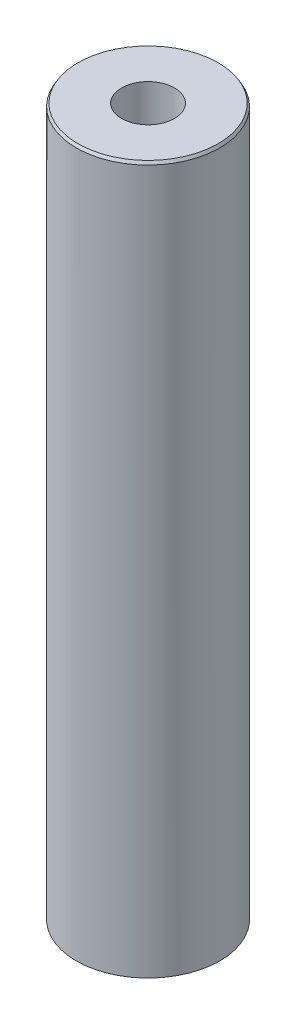
ISO-10303-21;
HEADER;
FILE_DESCRIPTION(('STEP AP214'),'2;1');
FILE_NAME('part.step','',(''),(''),'','','');
FILE_SCHEMA(('AUTOMOTIVE_DESIGN { 1 0 10303 214 1 1 1 1 }'));
ENDSEC;
DATA;
#1=APPLICATION_CONTEXT('core data for automotive mechanical design processes');
#2=APPLICATION_PROTOCOL_DEFINITION('international standard','automotive_design',2000,#1);
#3=PRODUCT_CONTEXT('',#1,'mechanical');
#4=PRODUCT('Part','Part','',(#3));
#5=PRODUCT_RELATED_PRODUCT_CATEGORY('part','',(#4));
#6=PRODUCT_DEFINITION_FORMATION('','',#4);
#7=PRODUCT_DEFINITION_CONTEXT('part definition',#1,'design');
#8=PRODUCT_DEFINITION('design','',#6,#7);
#9=PRODUCT_DEFINITION_SHAPE('','',#8);
#10=(LENGTH_UNIT() NAMED_UNIT(*) SI_UNIT(.MILLI.,.METRE.));
#11=(NAMED_UNIT(*) PLANE_ANGLE_UNIT() SI_UNIT($,.RADIAN.));
#12=(NAMED_UNIT(*) SI_UNIT($,.STERADIAN.) SOLID_ANGLE_UNIT());
#13=UNCERTAINTY_MEASURE_WITH_UNIT(LENGTH_MEASURE(1.E-05),#10,'distance_accuracy_value','');
#14=(GEOMETRIC_REPRESENTATION_CONTEXT(3) GLOBAL_UNCERTAINTY_ASSIGNED_CONTEXT((#13)) GLOBAL_UNIT_ASSIGNED_CONTEXT((#10,
#11,#12)) REPRESENTATION_CONTEXT('',''));
#15=CARTESIAN_POINT('',(0.,0.,0.));
#16=DIRECTION('',(0.,0.,1.));
#17=DIRECTION('',(1.,0.,0.));
#18=AXIS2_PLACEMENT_3D('',#15,#16,#17);
#19=CARTESIAN_POINT('',(0.,222.138337360227,0.));
#20=DIRECTION('',(0.,-1.,0.));
#21=DIRECTION('',(0.,0.,-1.));
#22=AXIS2_PLACEMENT_3D('',#19,#20,#21);
#23=CYLINDRICAL_SURFACE('',#22,22.5);
#24=CARTESIAN_POINT('',(0.,221.245079597205,0.));
#25=DIRECTION('',(0.,1.,0.));
#26=DIRECTION('',(0.,0.,1.));
#27=AXIS2_PLACEMENT_3D('',#24,#25,#26);
#28=CIRCLE('',#27,22.5);
#29=CARTESIAN_POINT('',(0.,221.245079597205,-22.5));
#30=VERTEX_POINT('',#29);
#31=EDGE_CURVE('E50',#30,#30,#28,.F.);
#32=ORIENTED_EDGE('',*,*,#31,.T.);
#33=EDGE_LOOP('',(#32));
#34=FACE_BOUND('',#33,.T.);
#35=CARTESIAN_POINT('',(0.,0.515722609936431,0.));
#36=DIRECTION('',(0.,1.,0.));
#37=DIRECTION('',(0.,0.,1.));
#38=AXIS2_PLACEMENT_3D('',#35,#36,#37);
#39=CIRCLE('',#38,22.5);
#40=CARTESIAN_POINT('',(0.,0.515722609936431,22.5));
#41=VERTEX_POINT('',#40);
#42=EDGE_CURVE('E51',#41,#41,#39,.T.);
#43=ORIENTED_EDGE('',*,*,#42,.T.);
#44=EDGE_LOOP('',(#43));
#45=FACE_BOUND('',#44,.T.);
#46=ADVANCED_FACE('F39',(#34,#45),#23,.T.);
#47=CARTESIAN_POINT('',(0.,222.138337360227,0.));
#48=DIRECTION('',(0.,1.,0.));
#49=DIRECTION('',(0.,0.,1.));
#50=AXIS2_PLACEMENT_3D('',#47,#48,#49);
#51=PLANE('',#50);
#52=CARTESIAN_POINT('',(0.,222.138337360227,0.));
#53=DIRECTION('',(0.,1.,0.));
#54=DIRECTION('',(0.,0.,1.));
#55=AXIS2_PLACEMENT_3D('',#52,#53,#54);
#56=CIRCLE('',#55,21.9842773900636);
#57=CARTESIAN_POINT('',(0.,222.138337360227,-21.9842773900636));
#58=VERTEX_POINT('',#57);
#59=EDGE_CURVE('E54',#58,#58,#56,.T.);
#60=ORIENTED_EDGE('',*,*,#59,.T.);
#61=EDGE_LOOP('',(#60));
#62=FACE_BOUND('',#61,.T.);
#63=CARTESIAN_POINT('',(0.,222.138337360227,0.));
#64=DIRECTION('',(0.,1.,0.));
#65=DIRECTION('',(0.,0.,1.));
#66=AXIS2_PLACEMENT_3D('',#63,#64,#65);
#67=CIRCLE('',#66,8.30021459850673);
#68=CARTESIAN_POINT('',(0.,222.138337360227,8.30021459850673));
#69=VERTEX_POINT('',#68);
#70=EDGE_CURVE('E58',#69,#69,#67,.T.);
#71=ORIENTED_EDGE('',*,*,#70,.F.);
#72=EDGE_LOOP('',(#71));
#73=FACE_BOUND('',#72,.T.);
#74=ADVANCED_FACE('F69',(#62,#73),#51,.T.);
#75=CARTESIAN_POINT('',(0.,0.,0.));
#76=DIRECTION('',(0.,1.,0.));
#77=DIRECTION('',(0.,0.,1.));
#78=AXIS2_PLACEMENT_3D('',#75,#76,#77);
#79=PLANE('',#78);
#80=CARTESIAN_POINT('',(0.,0.,0.));
#81=DIRECTION('',(0.,1.,0.));
#82=DIRECTION('',(0.,0.,1.));
#83=AXIS2_PLACEMENT_3D('',#80,#81,#82);
#84=CIRCLE('',#83,21.6067422369781);
#85=CARTESIAN_POINT('',(0.,0.,21.6067422369781));
#86=VERTEX_POINT('',#85);
#87=EDGE_CURVE('E10',#86,#86,#84,.F.);
#88=ORIENTED_EDGE('',*,*,#87,.T.);
#89=EDGE_LOOP('',(#88));
#90=FACE_BOUND('',#89,.T.);
#91=CARTESIAN_POINT('',(0.,0.,0.));
#92=DIRECTION('',(0.,1.,0.));
#93=DIRECTION('',(0.,0.,1.));
#94=AXIS2_PLACEMENT_3D('',#91,#92,#93);
#95=CIRCLE('',#94,8.30021459850673);
#96=CARTESIAN_POINT('',(0.,0.,8.30021459850673));
#97=VERTEX_POINT('',#96);
#98=EDGE_CURVE('E63',#97,#97,#95,.T.);
#99=ORIENTED_EDGE('',*,*,#98,.T.);
#100=EDGE_LOOP('',(#99));
#101=FACE_BOUND('',#100,.T.);
#102=ADVANCED_FACE('F75',(#90,#101),#79,.F.);
#103=CARTESIAN_POINT('',(0.,222.138337360227,0.));
#104=DIRECTION('',(0.,-1.,0.));
#105=DIRECTION('',(0.,0.,-1.));
#106=AXIS2_PLACEMENT_3D('',#103,#104,#105);
#107=CYLINDRICAL_SURFACE('',#106,8.30021459850673);
#108=ORIENTED_EDGE('',*,*,#70,.T.);
#109=EDGE_LOOP('',(#108));
#110=FACE_BOUND('',#109,.T.);
#111=ORIENTED_EDGE('',*,*,#98,.F.);
#112=EDGE_LOOP('',(#111));
#113=FACE_BOUND('',#112,.T.);
#114=ADVANCED_FACE('F70',(#110,#113),#107,.F.);
#115=CARTESIAN_POINT('',(0.,222.138337360227,0.));
#116=DIRECTION('',(0.,-1.,0.));
#117=DIRECTION('',(0.,0.,-1.));
#118=AXIS2_PLACEMENT_3D('',#115,#116,#117);
#119=CONICAL_SURFACE('',#118,21.9842773900636,0.523598775598308);
#120=CARTESIAN_POINT('',(0.,221.245079597205,-22.5));
#121=CARTESIAN_POINT('',(0.,221.25438436557,-22.4946278894798));
#122=CARTESIAN_POINT('',(0.,221.263689133935,-22.4892557789597));
#123=CARTESIAN_POINT('',(0.,221.282298670665,-22.4785115579193));
#124=CARTESIAN_POINT('',(0.,221.291603439029,-22.4731394473992));
#125=CARTESIAN_POINT('',(0.,221.310212975759,-22.4623952263588));
#126=CARTESIAN_POINT('',(0.,221.319517744124,-22.4570231158386));
#127=CARTESIAN_POINT('',(0.,221.338127280853,-22.4462788947983));
#128=CARTESIAN_POINT('',(0.,221.347432049218,-22.4409067842781));
#129=CARTESIAN_POINT('',(0.,221.366041585948,-22.4301625632378));
#130=CARTESIAN_POINT('',(0.,221.375346354313,-22.4247904527176));
#131=CARTESIAN_POINT('',(0.,221.393955891042,-22.4140462316773));
#132=CARTESIAN_POINT('',(0.,221.403260659407,-22.4086741211571));
#133=CARTESIAN_POINT('',(0.,221.421870196137,-22.3979299001168));
#134=CARTESIAN_POINT('',(0.,221.431174964502,-22.3925577895966));
#135=CARTESIAN_POINT('',(0.,221.449784501231,-22.3818135685563));
#136=CARTESIAN_POINT('',(0.,221.459089269596,-22.3764414580361));
#137=CARTESIAN_POINT('',(0.,221.477698806326,-22.3656972369957));
#138=CARTESIAN_POINT('',(0.,221.48700357469,-22.3603251264756));
#139=CARTESIAN_POINT('',(0.,221.50561311142,-22.3495809054352));
#140=CARTESIAN_POINT('',(0.,221.514917879785,-22.3442087949151));
#141=CARTESIAN_POINT('',(0.,221.533527416514,-22.3334645738747));
#142=CARTESIAN_POINT('',(0.,221.542832184879,-22.3280924633545));
#143=CARTESIAN_POINT('',(0.,221.561441721609,-22.3173482423142));
#144=CARTESIAN_POINT('',(0.,221.570746489974,-22.311976131794));
#145=CARTESIAN_POINT('',(0.,221.589356026703,-22.3012319107537));
#146=CARTESIAN_POINT('',(0.,221.598660795068,-22.2958598002335));
#147=CARTESIAN_POINT('',(0.,221.617270331798,-22.2851155791932));
#148=CARTESIAN_POINT('',(0.,221.626575100163,-22.279743468673));
#149=CARTESIAN_POINT('',(0.,221.645184636892,-22.2689992476327));
#150=CARTESIAN_POINT('',(0.,221.654489405257,-22.2636271371125));
#151=CARTESIAN_POINT('',(0.,221.673098941987,-22.2528829160721));
#152=CARTESIAN_POINT('',(0.,221.682403710351,-22.247510805552));
#153=CARTESIAN_POINT('',(0.,221.701013247081,-22.2367665845116));
#154=CARTESIAN_POINT('',(0.,221.710318015446,-22.2313944739915));
#155=CARTESIAN_POINT('',(0.,221.728927552176,-22.2206502529511));
#156=CARTESIAN_POINT('',(0.,221.73823232054,-22.215278142431));
#157=CARTESIAN_POINT('',(0.,221.75684185727,-22.2045339213906));
#158=CARTESIAN_POINT('',(0.,221.766146625635,-22.1991618108704));
#159=CARTESIAN_POINT('',(0.,221.784756162364,-22.1884175898301));
#160=CARTESIAN_POINT('',(0.,221.794060930729,-22.1830454793099));
#161=CARTESIAN_POINT('',(0.,221.812670467459,-22.1723012582696));
#162=CARTESIAN_POINT('',(0.,221.821975235824,-22.1669291477494));
#163=CARTESIAN_POINT('',(0.,221.840584772553,-22.1561849267091));
#164=CARTESIAN_POINT('',(0.,221.849889540918,-22.1508128161889));
#165=CARTESIAN_POINT('',(0.,221.868499077648,-22.1400685951486));
#166=CARTESIAN_POINT('',(0.,221.877803846012,-22.1346964846284));
#167=CARTESIAN_POINT('',(0.,221.896413382742,-22.123952263588));
#168=CARTESIAN_POINT('',(0.,221.905718151107,-22.1185801530679));
#169=CARTESIAN_POINT('',(0.,221.924327687837,-22.1078359320275));
#170=CARTESIAN_POINT('',(0.,221.933632456201,-22.1024638215074));
#171=CARTESIAN_POINT('',(0.,221.952241992931,-22.091719600467));
#172=CARTESIAN_POINT('',(0.,221.961546761296,-22.0863474899468));
#173=CARTESIAN_POINT('',(0.,221.980156298025,-22.0756032689065));
#174=CARTESIAN_POINT('',(0.,221.98946106639,-22.0702311583863));
#175=CARTESIAN_POINT('',(0.,222.00807060312,-22.059486937346));
#176=CARTESIAN_POINT('',(0.,222.017375371485,-22.0541148268258));
#177=CARTESIAN_POINT('',(0.,222.035984908214,-22.0433706057855));
#178=CARTESIAN_POINT('',(0.,222.045289676579,-22.0379984952653));
#179=CARTESIAN_POINT('',(0.,222.063899213309,-22.027254274225));
#180=CARTESIAN_POINT('',(0.,222.073203981674,-22.0218821637048));
#181=CARTESIAN_POINT('',(0.,222.091813518403,-22.0111379426645));
#182=CARTESIAN_POINT('',(0.,222.101118286768,-22.0057658321443));
#183=CARTESIAN_POINT('',(0.,222.119727823498,-21.9950216111039));
#184=CARTESIAN_POINT('',(0.,222.129032591862,-21.9896495005838));
#185=CARTESIAN_POINT('',(0.,222.138337360227,-21.9842773900636));
#186=B_SPLINE_CURVE_WITH_KNOTS('',3,(#120,#121,#122,#123,#124,#125,#126,#127,#128,#129,#130,
#131,#132,#133,#134,#135,#136,#137,#138,#139,#140,#141,#142,#143,#144,#145,#146,#147,#148,#149,
#150,#151,#152,#153,#154,#155,#156,#157,#158,#159,#160,#161,#162,#163,#164,#165,#166,#167,#168,
#169,#170,#171,#172,#173,#174,#175,#176,#177,#178,#179,#180,#181,#182,#183,#184,#185),
.UNSPECIFIED.,.F.,.F.,(4,2,2,2,2,2,2,2,2,2,2,2,2,2,2,2,2,2,2,2,2,2,2,2,2,2,2,2,2,2,2,2,4),(0.,
0.03223266312103,0.0644653262420601,0.0966979893630918,0.128930652484122,0.161163315605128,
0.19339597872616,0.22562864184719,0.25786130496822,0.290093968089251,0.322326631210257,
0.354559294331287,0.386791957452319,0.419024620573349,0.451257283694357,0.483489946815387,
0.515722609936417,0.547955273057449,0.580187936178479,0.612420599299485,0.644653262420517,
0.676885925541547,0.709118588662577,0.741351251783585,0.773583914904615,0.805816578025645,
0.838049241146677,0.870281904267707,0.902514567388713,0.934747230509745,0.966979893630775,
0.999212556751805,1.03144521987284),.UNSPECIFIED.);
#187=EDGE_CURVE('BSEAM81',#30,#58,#186,.T.);
#188=ORIENTED_EDGE('',*,*,#31,.F.);
#189=ORIENTED_EDGE('',*,*,#59,.F.);
#190=ORIENTED_EDGE('',*,*,#187,.T.);
#191=ORIENTED_EDGE('',*,*,#187,.F.);
#192=EDGE_LOOP('',(#188,#190,#189,#191));
#193=FACE_BOUND('',#192,.T.);
#194=ADVANCED_FACE('F81',(#193),#119,.T.);
#195=CARTESIAN_POINT('',(0.,0.515722609936431,0.));
#196=DIRECTION('',(0.,1.,0.));
#197=DIRECTION('',(0.,0.,1.));
#198=AXIS2_PLACEMENT_3D('',#195,#196,#197);
#199=CONICAL_SURFACE('',#198,22.5,1.04719755119659);
#200=ORIENTED_EDGE('',*,*,#87,.F.);
#201=EDGE_LOOP('',(#200));
#202=FACE_BOUND('',#201,.T.);
#203=ORIENTED_EDGE('',*,*,#42,.F.);
#204=EDGE_LOOP('',(#203));
#205=FACE_BOUND('',#204,.T.);
#206=ADVANCED_FACE('F45',(#202,#205),#199,.T.);
#207=CLOSED_SHELL('',(#46,#74,#102,#114,#194,#206));
#208=MANIFOLD_SOLID_BREP('B2',#207);
#209=ADVANCED_BREP_SHAPE_REPRESENTATION('',(#18,#208),#14);
#210=SHAPE_DEFINITION_REPRESENTATION(#9,#209);
ENDSEC;
END-ISO-10303-21;
